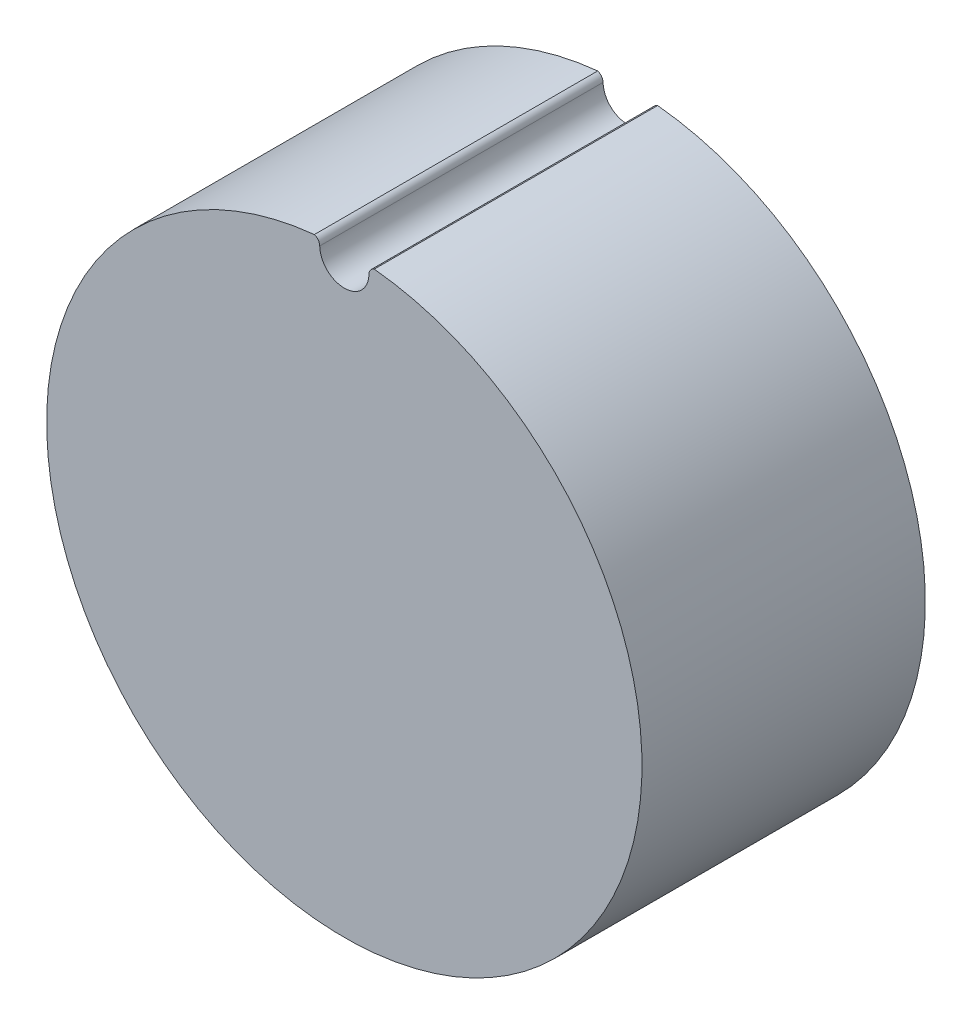
ISO-10303-21;
HEADER;
FILE_DESCRIPTION(('STEP AP214'),'2;1');
FILE_NAME('part.step','',(''),(''),'','','');
FILE_SCHEMA(('AUTOMOTIVE_DESIGN { 1 0 10303 214 1 1 1 1 }'));
ENDSEC;
DATA;
#1=APPLICATION_CONTEXT('core data for automotive mechanical design processes');
#2=APPLICATION_PROTOCOL_DEFINITION('international standard','automotive_design',2000,#1);
#3=PRODUCT_CONTEXT('',#1,'mechanical');
#4=PRODUCT('Part','Part','',(#3));
#5=PRODUCT_RELATED_PRODUCT_CATEGORY('part','',(#4));
#6=PRODUCT_DEFINITION_FORMATION('','',#4);
#7=PRODUCT_DEFINITION_CONTEXT('part definition',#1,'design');
#8=PRODUCT_DEFINITION('design','',#6,#7);
#9=PRODUCT_DEFINITION_SHAPE('','',#8);
#10=(LENGTH_UNIT() NAMED_UNIT(*) SI_UNIT(.MILLI.,.METRE.));
#11=(NAMED_UNIT(*) PLANE_ANGLE_UNIT() SI_UNIT($,.RADIAN.));
#12=(NAMED_UNIT(*) SI_UNIT($,.STERADIAN.) SOLID_ANGLE_UNIT());
#13=UNCERTAINTY_MEASURE_WITH_UNIT(LENGTH_MEASURE(1.E-05),#10,'distance_accuracy_value','');
#14=(GEOMETRIC_REPRESENTATION_CONTEXT(3) GLOBAL_UNCERTAINTY_ASSIGNED_CONTEXT((#13)) GLOBAL_UNIT_ASSIGNED_CONTEXT((#10,
#11,#12)) REPRESENTATION_CONTEXT('',''));
#15=CARTESIAN_POINT('',(0.,0.,0.));
#16=DIRECTION('',(0.,0.,1.));
#17=DIRECTION('',(1.,0.,0.));
#18=AXIS2_PLACEMENT_3D('',#15,#16,#17);
#19=CARTESIAN_POINT('',(0.,0.,11.));
#20=DIRECTION('',(0.,0.,-1.));
#21=DIRECTION('',(-1.,0.,0.));
#22=AXIS2_PLACEMENT_3D('',#19,#20,#21);
#23=CYLINDRICAL_SURFACE('',#22,11.555);
#24=DIRECTION('',(0.,0.,1.));
#25=VECTOR('',#24,1.);
#26=CARTESIAN_POINT('',(1.16255003917381,11.4963690966503,-0.000999999999999265));
#27=LINE('',#26,#25);
#28=CARTESIAN_POINT('',(1.16255003917381,11.4963690966503,0.));
#29=VERTEX_POINT('',#28);
#30=CARTESIAN_POINT('',(1.16255003917381,11.4963690966503,11.));
#31=VERTEX_POINT('',#30);
#32=EDGE_CURVE('E70',#29,#31,#27,.T.);
#33=ORIENTED_EDGE('',*,*,#32,.T.);
#34=CARTESIAN_POINT('',(0.,0.,11.));
#35=DIRECTION('',(0.,0.,1.));
#36=DIRECTION('',(1.,0.,0.));
#37=AXIS2_PLACEMENT_3D('',#34,#35,#36);
#38=CIRCLE('',#37,11.555);
#39=CARTESIAN_POINT('',(-1.16255003917381,11.4963690966503,11.));
#40=VERTEX_POINT('',#39);
#41=EDGE_CURVE('E11',#40,#31,#38,.T.);
#42=ORIENTED_EDGE('',*,*,#41,.F.);
#43=DIRECTION('',(0.,0.,1.));
#44=VECTOR('',#43,1.);
#45=CARTESIAN_POINT('',(-1.16255003917381,11.4963690966503,-0.000999999999999265));
#46=LINE('',#45,#44);
#47=CARTESIAN_POINT('',(-1.16255003917381,11.4963690966503,0.));
#48=VERTEX_POINT('',#47);
#49=EDGE_CURVE('E79',#48,#40,#46,.T.);
#50=ORIENTED_EDGE('',*,*,#49,.F.);
#51=CARTESIAN_POINT('',(0.,0.,0.));
#52=DIRECTION('',(0.,0.,1.));
#53=DIRECTION('',(1.,0.,0.));
#54=AXIS2_PLACEMENT_3D('',#51,#52,#53);
#55=CIRCLE('',#54,11.555);
#56=EDGE_CURVE('E35',#48,#29,#55,.T.);
#57=ORIENTED_EDGE('',*,*,#56,.T.);
#58=EDGE_LOOP('',(#33,#42,#50,#57));
#59=FACE_BOUND('',#58,.T.);
#60=ADVANCED_FACE('F32',(#59),#23,.T.);
#61=CARTESIAN_POINT('',(0.,0.,11.));
#62=DIRECTION('',(0.,0.,1.));
#63=DIRECTION('',(1.,0.,0.));
#64=AXIS2_PLACEMENT_3D('',#61,#62,#63);
#65=PLANE('',#64);
#66=ORIENTED_EDGE('',*,*,#41,.T.);
#67=CARTESIAN_POINT('',(1.25496506723067,11.2109580551869,11.));
#68=DIRECTION('',(0.,0.,1.));
#69=DIRECTION('',(1.,0.,0.));
#70=AXIS2_PLACEMENT_3D('',#67,#68,#69);
#71=CIRCLE('',#70,0.299999999999999);
#72=CARTESIAN_POINT('',(0.955,11.2155360942103,11.));
#73=VERTEX_POINT('',#72);
#74=EDGE_CURVE('E75',#31,#73,#71,.T.);
#75=ORIENTED_EDGE('',*,*,#74,.T.);
#76=CARTESIAN_POINT('',(0.,11.2301112155993,11.));
#77=DIRECTION('',(0.,0.,1.));
#78=DIRECTION('',(1.,0.,0.));
#79=AXIS2_PLACEMENT_3D('',#76,#77,#78);
#80=CIRCLE('',#79,0.955111215599263);
#81=CARTESIAN_POINT('',(-0.955,11.2155360942103,11.));
#82=VERTEX_POINT('',#81);
#83=EDGE_CURVE('E80',#82,#73,#80,.T.);
#84=ORIENTED_EDGE('',*,*,#83,.F.);
#85=CARTESIAN_POINT('',(-1.25496506723067,11.2109580551869,11.));
#86=DIRECTION('',(0.,0.,1.));
#87=DIRECTION('',(1.,0.,0.));
#88=AXIS2_PLACEMENT_3D('',#85,#86,#87);
#89=CIRCLE('',#88,0.3);
#90=EDGE_CURVE('E98',#40,#82,#89,.F.);
#91=ORIENTED_EDGE('',*,*,#90,.F.);
#92=EDGE_LOOP('',(#66,#75,#84,#91));
#93=FACE_BOUND('',#92,.T.);
#94=ADVANCED_FACE('F102',(#93),#65,.T.);
#95=CARTESIAN_POINT('',(0.,0.,0.));
#96=DIRECTION('',(0.,0.,1.));
#97=DIRECTION('',(1.,0.,0.));
#98=AXIS2_PLACEMENT_3D('',#95,#96,#97);
#99=PLANE('',#98);
#100=CARTESIAN_POINT('',(1.25496506723067,11.2109580551869,0.));
#101=DIRECTION('',(0.,0.,1.));
#102=DIRECTION('',(1.,0.,0.));
#103=AXIS2_PLACEMENT_3D('',#100,#101,#102);
#104=CIRCLE('',#103,0.299999999999999);
#105=CARTESIAN_POINT('',(0.955,11.2155360942103,0.));
#106=VERTEX_POINT('',#105);
#107=EDGE_CURVE('E73',#106,#29,#104,.F.);
#108=ORIENTED_EDGE('',*,*,#107,.T.);
#109=ORIENTED_EDGE('',*,*,#56,.F.);
#110=CARTESIAN_POINT('',(-1.25496506723067,11.2109580551869,0.));
#111=DIRECTION('',(0.,0.,1.));
#112=DIRECTION('',(1.,0.,0.));
#113=AXIS2_PLACEMENT_3D('',#110,#111,#112);
#114=CIRCLE('',#113,0.3);
#115=CARTESIAN_POINT('',(-0.955,11.2155360942103,0.));
#116=VERTEX_POINT('',#115);
#117=EDGE_CURVE('E100',#116,#48,#114,.T.);
#118=ORIENTED_EDGE('',*,*,#117,.F.);
#119=CARTESIAN_POINT('',(0.,11.2301112155993,0.));
#120=DIRECTION('',(0.,0.,1.));
#121=DIRECTION('',(1.,0.,0.));
#122=AXIS2_PLACEMENT_3D('',#119,#120,#121);
#123=CIRCLE('',#122,0.955111215599263);
#124=EDGE_CURVE('E46',#106,#116,#123,.F.);
#125=ORIENTED_EDGE('',*,*,#124,.F.);
#126=EDGE_LOOP('',(#108,#109,#118,#125));
#127=FACE_BOUND('',#126,.T.);
#128=ADVANCED_FACE('F84',(#127),#99,.F.);
#129=CARTESIAN_POINT('',(1.25496506723067,11.2109580551869,-0.000999999999999265));
#130=DIRECTION('',(0.,0.,1.));
#131=DIRECTION('',(1.,0.,0.));
#132=AXIS2_PLACEMENT_3D('',#129,#130,#131);
#133=CYLINDRICAL_SURFACE('',#132,0.299999999999999);
#134=DIRECTION('',(0.,0.,1.));
#135=VECTOR('',#134,1.);
#136=CARTESIAN_POINT('',(0.955,11.2155360942103,-0.000999999999999265));
#137=LINE('',#136,#135);
#138=EDGE_CURVE('E51',#106,#73,#137,.T.);
#139=ORIENTED_EDGE('',*,*,#138,.T.);
#140=ORIENTED_EDGE('',*,*,#74,.F.);
#141=ORIENTED_EDGE('',*,*,#32,.F.);
#142=ORIENTED_EDGE('',*,*,#107,.F.);
#143=EDGE_LOOP('',(#139,#140,#141,#142));
#144=FACE_BOUND('',#143,.T.);
#145=ADVANCED_FACE('F72',(#144),#133,.T.);
#146=CARTESIAN_POINT('',(0.,11.2301112155993,-0.000999999999999265));
#147=DIRECTION('',(0.,0.,1.));
#148=DIRECTION('',(1.,0.,0.));
#149=AXIS2_PLACEMENT_3D('',#146,#147,#148);
#150=CYLINDRICAL_SURFACE('',#149,0.955111215599263);
#151=ORIENTED_EDGE('',*,*,#124,.T.);
#152=DIRECTION('',(0.,0.,1.));
#153=VECTOR('',#152,1.);
#154=CARTESIAN_POINT('',(-0.955,11.2155360942103,-0.000999999999999265));
#155=LINE('',#154,#153);
#156=EDGE_CURVE('E88',#116,#82,#155,.T.);
#157=ORIENTED_EDGE('',*,*,#156,.T.);
#158=ORIENTED_EDGE('',*,*,#83,.T.);
#159=ORIENTED_EDGE('',*,*,#138,.F.);
#160=EDGE_LOOP('',(#151,#157,#158,#159));
#161=FACE_BOUND('',#160,.T.);
#162=ADVANCED_FACE('F106',(#161),#150,.F.);
#163=CARTESIAN_POINT('',(-1.25496506723067,11.2109580551869,-0.000999999999999265));
#164=DIRECTION('',(0.,0.,1.));
#165=DIRECTION('',(1.,0.,0.));
#166=AXIS2_PLACEMENT_3D('',#163,#164,#165);
#167=CYLINDRICAL_SURFACE('',#166,0.3);
#168=ORIENTED_EDGE('',*,*,#117,.T.);
#169=ORIENTED_EDGE('',*,*,#49,.T.);
#170=ORIENTED_EDGE('',*,*,#90,.T.);
#171=ORIENTED_EDGE('',*,*,#156,.F.);
#172=EDGE_LOOP('',(#168,#169,#170,#171));
#173=FACE_BOUND('',#172,.T.);
#174=ADVANCED_FACE('F97',(#173),#167,.T.);
#175=CLOSED_SHELL('',(#60,#94,#128,#145,#162,#174));
#176=MANIFOLD_SOLID_BREP('B2',#175);
#177=ADVANCED_BREP_SHAPE_REPRESENTATION('',(#18,#176),#14);
#178=SHAPE_DEFINITION_REPRESENTATION(#9,#177);
ENDSEC;
END-ISO-10303-21;
